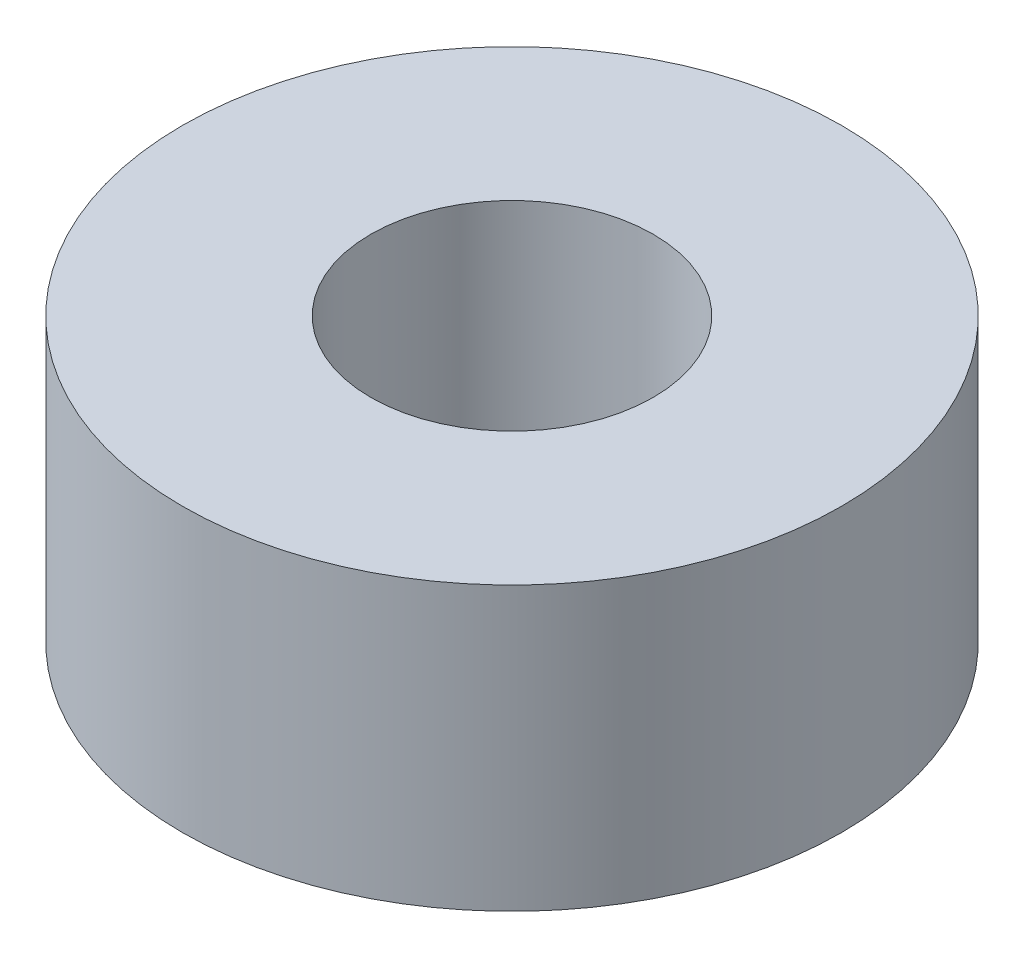
ISO-10303-21;
HEADER;
FILE_DESCRIPTION(('STEP AP214'),'2;1');
FILE_NAME('part.step','',(''),(''),'','','');
FILE_SCHEMA(('AUTOMOTIVE_DESIGN { 1 0 10303 214 1 1 1 1 }'));
ENDSEC;
DATA;
#1=APPLICATION_CONTEXT('core data for automotive mechanical design processes');
#2=APPLICATION_PROTOCOL_DEFINITION('international standard','automotive_design',2000,#1);
#3=PRODUCT_CONTEXT('',#1,'mechanical');
#4=PRODUCT('Part','Part','',(#3));
#5=PRODUCT_RELATED_PRODUCT_CATEGORY('part','',(#4));
#6=PRODUCT_DEFINITION_FORMATION('','',#4);
#7=PRODUCT_DEFINITION_CONTEXT('part definition',#1,'design');
#8=PRODUCT_DEFINITION('design','',#6,#7);
#9=PRODUCT_DEFINITION_SHAPE('','',#8);
#10=(LENGTH_UNIT() NAMED_UNIT(*) SI_UNIT(.MILLI.,.METRE.));
#11=(NAMED_UNIT(*) PLANE_ANGLE_UNIT() SI_UNIT($,.RADIAN.));
#12=(NAMED_UNIT(*) SI_UNIT($,.STERADIAN.) SOLID_ANGLE_UNIT());
#13=UNCERTAINTY_MEASURE_WITH_UNIT(LENGTH_MEASURE(1.E-05),#10,'distance_accuracy_value','');
#14=(GEOMETRIC_REPRESENTATION_CONTEXT(3) GLOBAL_UNCERTAINTY_ASSIGNED_CONTEXT((#13)) GLOBAL_UNIT_ASSIGNED_CONTEXT((#10,
#11,#12)) REPRESENTATION_CONTEXT('',''));
#15=CARTESIAN_POINT('',(0.,0.,0.));
#16=DIRECTION('',(0.,0.,1.));
#17=DIRECTION('',(1.,0.,0.));
#18=AXIS2_PLACEMENT_3D('',#15,#16,#17);
#19=CARTESIAN_POINT('',(0.,3.,0.));
#20=DIRECTION('',(0.,1.,0.));
#21=DIRECTION('',(0.,0.,1.));
#22=AXIS2_PLACEMENT_3D('',#19,#20,#21);
#23=PLANE('',#22);
#24=CARTESIAN_POINT('',(0.,3.,0.));
#25=DIRECTION('',(0.,1.,0.));
#26=DIRECTION('',(0.,0.,1.));
#27=AXIS2_PLACEMENT_3D('',#24,#25,#26);
#28=CIRCLE('',#27,3.5);
#29=CARTESIAN_POINT('',(0.,3.,3.5));
#30=VERTEX_POINT('',#29);
#31=EDGE_CURVE('E10',#30,#30,#28,.T.);
#32=ORIENTED_EDGE('',*,*,#31,.T.);
#33=EDGE_LOOP('',(#32));
#34=FACE_BOUND('',#33,.T.);
#35=CARTESIAN_POINT('',(0.,3.,0.));
#36=DIRECTION('',(0.,1.,0.));
#37=DIRECTION('',(0.,0.,1.));
#38=AXIS2_PLACEMENT_3D('',#35,#36,#37);
#39=CIRCLE('',#38,1.5);
#40=CARTESIAN_POINT('',(0.,3.,1.5));
#41=VERTEX_POINT('',#40);
#42=EDGE_CURVE('E42',#41,#41,#39,.T.);
#43=ORIENTED_EDGE('',*,*,#42,.F.);
#44=EDGE_LOOP('',(#43));
#45=FACE_BOUND('',#44,.T.);
#46=ADVANCED_FACE('F31',(#34,#45),#23,.T.);
#47=CARTESIAN_POINT('',(0.,0.,0.));
#48=DIRECTION('',(0.,1.,0.));
#49=DIRECTION('',(0.,0.,1.));
#50=AXIS2_PLACEMENT_3D('',#47,#48,#49);
#51=PLANE('',#50);
#52=CARTESIAN_POINT('',(0.,0.,0.));
#53=DIRECTION('',(0.,1.,0.));
#54=DIRECTION('',(0.,0.,1.));
#55=AXIS2_PLACEMENT_3D('',#52,#53,#54);
#56=CIRCLE('',#55,3.5);
#57=CARTESIAN_POINT('',(0.,0.,3.5));
#58=VERTEX_POINT('',#57);
#59=EDGE_CURVE('E35',#58,#58,#56,.T.);
#60=ORIENTED_EDGE('',*,*,#59,.F.);
#61=EDGE_LOOP('',(#60));
#62=FACE_BOUND('',#61,.T.);
#63=CARTESIAN_POINT('',(0.,0.,0.));
#64=DIRECTION('',(0.,1.,0.));
#65=DIRECTION('',(0.,0.,1.));
#66=AXIS2_PLACEMENT_3D('',#63,#64,#65);
#67=CIRCLE('',#66,1.5);
#68=CARTESIAN_POINT('',(0.,0.,1.5));
#69=VERTEX_POINT('',#68);
#70=EDGE_CURVE('E44',#69,#69,#67,.T.);
#71=ORIENTED_EDGE('',*,*,#70,.T.);
#72=EDGE_LOOP('',(#71));
#73=FACE_BOUND('',#72,.T.);
#74=ADVANCED_FACE('F54',(#62,#73),#51,.F.);
#75=CARTESIAN_POINT('',(0.,3.,0.));
#76=DIRECTION('',(0.,-1.,0.));
#77=DIRECTION('',(0.,0.,-1.));
#78=AXIS2_PLACEMENT_3D('',#75,#76,#77);
#79=CYLINDRICAL_SURFACE('',#78,3.5);
#80=ORIENTED_EDGE('',*,*,#31,.F.);
#81=EDGE_LOOP('',(#80));
#82=FACE_BOUND('',#81,.T.);
#83=ORIENTED_EDGE('',*,*,#59,.T.);
#84=EDGE_LOOP('',(#83));
#85=FACE_BOUND('',#84,.T.);
#86=ADVANCED_FACE('F33',(#82,#85),#79,.T.);
#87=CARTESIAN_POINT('',(0.,3.,0.));
#88=DIRECTION('',(0.,-1.,0.));
#89=DIRECTION('',(0.,0.,-1.));
#90=AXIS2_PLACEMENT_3D('',#87,#88,#89);
#91=CYLINDRICAL_SURFACE('',#90,1.5);
#92=ORIENTED_EDGE('',*,*,#42,.T.);
#93=EDGE_LOOP('',(#92));
#94=FACE_BOUND('',#93,.T.);
#95=ORIENTED_EDGE('',*,*,#70,.F.);
#96=EDGE_LOOP('',(#95));
#97=FACE_BOUND('',#96,.T.);
#98=ADVANCED_FACE('F50',(#94,#97),#91,.F.);
#99=CLOSED_SHELL('',(#46,#74,#86,#98));
#100=MANIFOLD_SOLID_BREP('B2',#99);
#101=ADVANCED_BREP_SHAPE_REPRESENTATION('',(#18,#100),#14);
#102=SHAPE_DEFINITION_REPRESENTATION(#9,#101);
ENDSEC;
END-ISO-10303-21;
